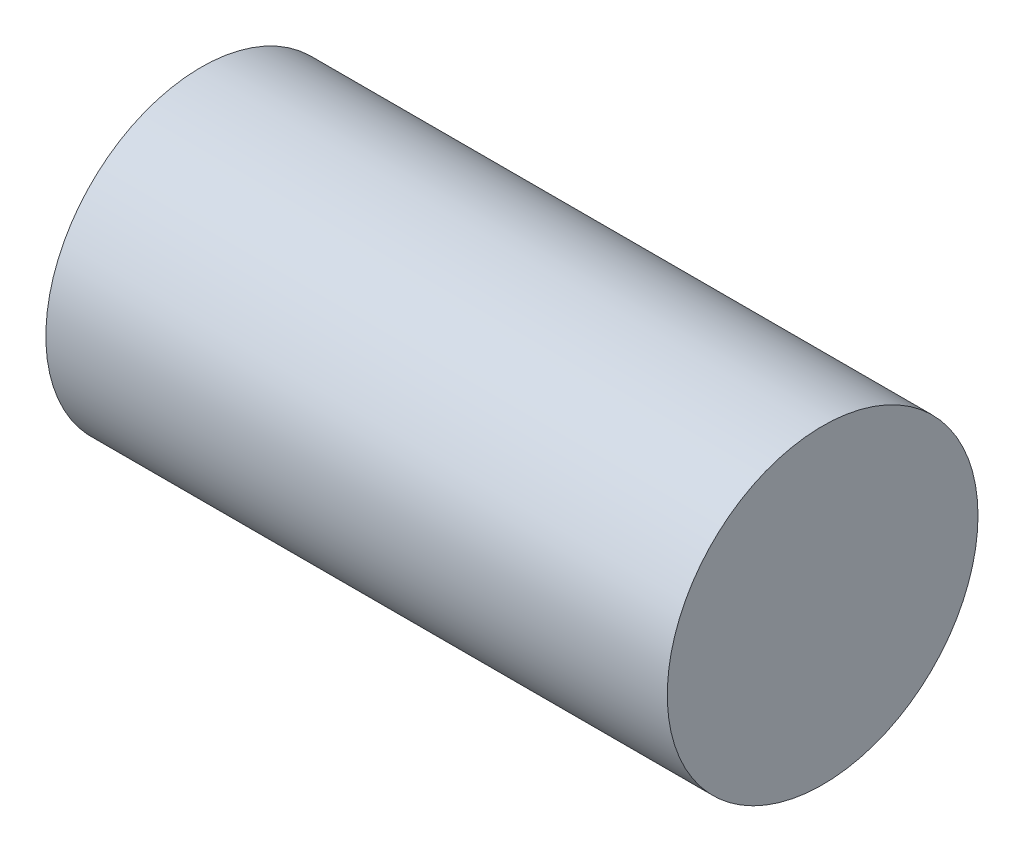
ISO-10303-21;
HEADER;
FILE_DESCRIPTION(('STEP AP214'),'2;1');
FILE_NAME('part.step','',(''),(''),'','','');
FILE_SCHEMA(('AUTOMOTIVE_DESIGN { 1 0 10303 214 1 1 1 1 }'));
ENDSEC;
DATA;
#1=APPLICATION_CONTEXT('core data for automotive mechanical design processes');
#2=APPLICATION_PROTOCOL_DEFINITION('international standard','automotive_design',2000,#1);
#3=PRODUCT_CONTEXT('',#1,'mechanical');
#4=PRODUCT('Part','Part','',(#3));
#5=PRODUCT_RELATED_PRODUCT_CATEGORY('part','',(#4));
#6=PRODUCT_DEFINITION_FORMATION('','',#4);
#7=PRODUCT_DEFINITION_CONTEXT('part definition',#1,'design');
#8=PRODUCT_DEFINITION('design','',#6,#7);
#9=PRODUCT_DEFINITION_SHAPE('','',#8);
#10=(LENGTH_UNIT() NAMED_UNIT(*) SI_UNIT(.MILLI.,.METRE.));
#11=(NAMED_UNIT(*) PLANE_ANGLE_UNIT() SI_UNIT($,.RADIAN.));
#12=(NAMED_UNIT(*) SI_UNIT($,.STERADIAN.) SOLID_ANGLE_UNIT());
#13=UNCERTAINTY_MEASURE_WITH_UNIT(LENGTH_MEASURE(1.E-05),#10,'distance_accuracy_value','');
#14=(GEOMETRIC_REPRESENTATION_CONTEXT(3) GLOBAL_UNCERTAINTY_ASSIGNED_CONTEXT((#13)) GLOBAL_UNIT_ASSIGNED_CONTEXT((#10,
#11,#12)) REPRESENTATION_CONTEXT('',''));
#15=CARTESIAN_POINT('',(0.,0.,0.));
#16=DIRECTION('',(0.,0.,1.));
#17=DIRECTION('',(1.,0.,0.));
#18=AXIS2_PLACEMENT_3D('',#15,#16,#17);
#19=CARTESIAN_POINT('',(10.,0.,0.));
#20=DIRECTION('',(-1.,0.,0.));
#21=DIRECTION('',(0.,0.,1.));
#22=AXIS2_PLACEMENT_3D('',#19,#20,#21);
#23=CYLINDRICAL_SURFACE('',#22,2.5);
#24=CARTESIAN_POINT('',(10.,0.,0.));
#25=DIRECTION('',(1.,0.,0.));
#26=DIRECTION('',(0.,0.,-1.));
#27=AXIS2_PLACEMENT_3D('',#24,#25,#26);
#28=CIRCLE('',#27,2.5);
#29=CARTESIAN_POINT('',(10.,0.,-2.5));
#30=VERTEX_POINT('',#29);
#31=EDGE_CURVE('E10',#30,#30,#28,.T.);
#32=ORIENTED_EDGE('',*,*,#31,.F.);
#33=EDGE_LOOP('',(#32));
#34=FACE_BOUND('',#33,.T.);
#35=CARTESIAN_POINT('',(0.,0.,0.));
#36=DIRECTION('',(1.,0.,0.));
#37=DIRECTION('',(0.,0.,-1.));
#38=AXIS2_PLACEMENT_3D('',#35,#36,#37);
#39=CIRCLE('',#38,2.5);
#40=CARTESIAN_POINT('',(0.,0.,-2.5));
#41=VERTEX_POINT('',#40);
#42=EDGE_CURVE('E34',#41,#41,#39,.T.);
#43=ORIENTED_EDGE('',*,*,#42,.T.);
#44=EDGE_LOOP('',(#43));
#45=FACE_BOUND('',#44,.T.);
#46=ADVANCED_FACE('F31',(#34,#45),#23,.T.);
#47=CARTESIAN_POINT('',(10.,0.,0.));
#48=DIRECTION('',(1.,0.,0.));
#49=DIRECTION('',(0.,0.,-1.));
#50=AXIS2_PLACEMENT_3D('',#47,#48,#49);
#51=PLANE('',#50);
#52=ORIENTED_EDGE('',*,*,#31,.T.);
#53=EDGE_LOOP('',(#52));
#54=FACE_BOUND('',#53,.T.);
#55=ADVANCED_FACE('F46',(#54),#51,.T.);
#56=CARTESIAN_POINT('',(0.,0.,0.));
#57=DIRECTION('',(1.,0.,0.));
#58=DIRECTION('',(0.,0.,-1.));
#59=AXIS2_PLACEMENT_3D('',#56,#57,#58);
#60=PLANE('',#59);
#61=ORIENTED_EDGE('',*,*,#42,.F.);
#62=EDGE_LOOP('',(#61));
#63=FACE_BOUND('',#62,.T.);
#64=ADVANCED_FACE('F44',(#63),#60,.F.);
#65=CLOSED_SHELL('',(#46,#55,#64));
#66=MANIFOLD_SOLID_BREP('B2',#65);
#67=ADVANCED_BREP_SHAPE_REPRESENTATION('',(#18,#66),#14);
#68=SHAPE_DEFINITION_REPRESENTATION(#9,#67);
ENDSEC;
END-ISO-10303-21;
